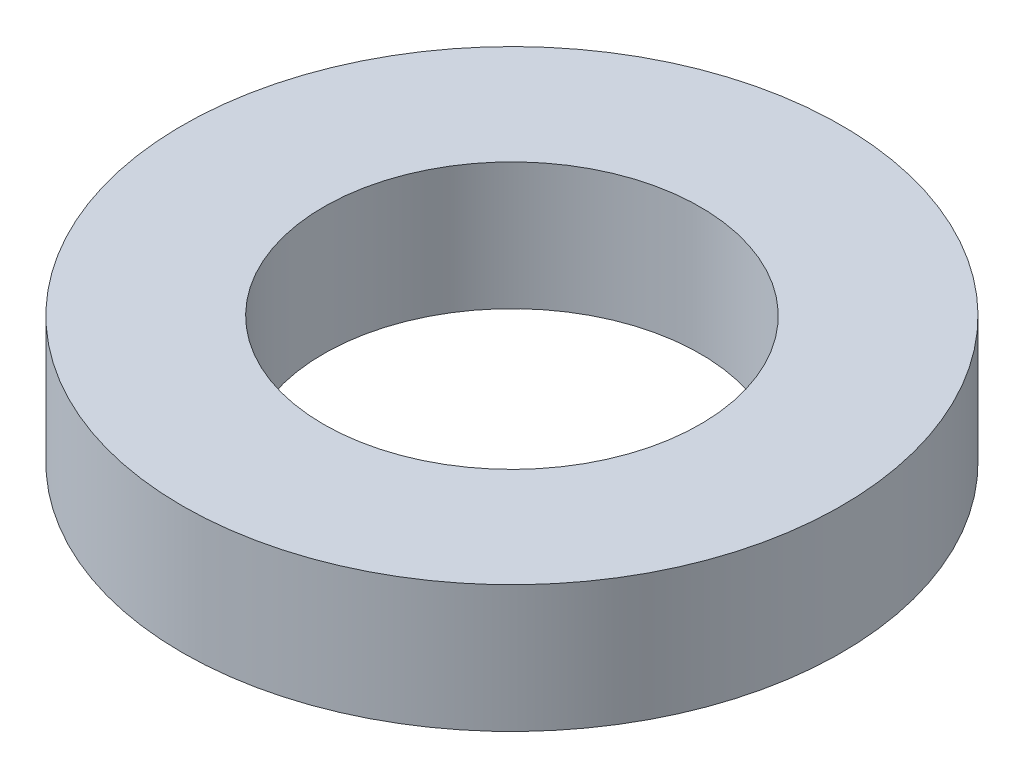
ISO-10303-21;
HEADER;
FILE_DESCRIPTION(('STEP AP214'),'2;1');
FILE_NAME('part.step','',(''),(''),'','','');
FILE_SCHEMA(('AUTOMOTIVE_DESIGN { 1 0 10303 214 1 1 1 1 }'));
ENDSEC;
DATA;
#1=APPLICATION_CONTEXT('core data for automotive mechanical design processes');
#2=APPLICATION_PROTOCOL_DEFINITION('international standard','automotive_design',2000,#1);
#3=PRODUCT_CONTEXT('',#1,'mechanical');
#4=PRODUCT('Part','Part','',(#3));
#5=PRODUCT_RELATED_PRODUCT_CATEGORY('part','',(#4));
#6=PRODUCT_DEFINITION_FORMATION('','',#4);
#7=PRODUCT_DEFINITION_CONTEXT('part definition',#1,'design');
#8=PRODUCT_DEFINITION('design','',#6,#7);
#9=PRODUCT_DEFINITION_SHAPE('','',#8);
#10=(LENGTH_UNIT() NAMED_UNIT(*) SI_UNIT(.MILLI.,.METRE.));
#11=(NAMED_UNIT(*) PLANE_ANGLE_UNIT() SI_UNIT($,.RADIAN.));
#12=(NAMED_UNIT(*) SI_UNIT($,.STERADIAN.) SOLID_ANGLE_UNIT());
#13=UNCERTAINTY_MEASURE_WITH_UNIT(LENGTH_MEASURE(1.E-05),#10,'distance_accuracy_value','');
#14=(GEOMETRIC_REPRESENTATION_CONTEXT(3) GLOBAL_UNCERTAINTY_ASSIGNED_CONTEXT((#13)) GLOBAL_UNIT_ASSIGNED_CONTEXT((#10,
#11,#12)) REPRESENTATION_CONTEXT('',''));
#15=CARTESIAN_POINT('',(0.,0.,0.));
#16=DIRECTION('',(0.,0.,1.));
#17=DIRECTION('',(1.,0.,0.));
#18=AXIS2_PLACEMENT_3D('',#15,#16,#17);
#19=CARTESIAN_POINT('',(0.,27.,0.));
#20=DIRECTION('',(0.,-1.,0.));
#21=DIRECTION('',(0.,0.,-1.));
#22=AXIS2_PLACEMENT_3D('',#19,#20,#21);
#23=CYLINDRICAL_SURFACE('',#22,70.);
#24=CARTESIAN_POINT('',(0.,27.,0.));
#25=DIRECTION('',(0.,1.,0.));
#26=DIRECTION('',(0.,0.,1.));
#27=AXIS2_PLACEMENT_3D('',#24,#25,#26);
#28=CIRCLE('',#27,70.);
#29=CARTESIAN_POINT('',(0.,27.,70.));
#30=VERTEX_POINT('',#29);
#31=EDGE_CURVE('E10',#30,#30,#28,.T.);
#32=ORIENTED_EDGE('',*,*,#31,.F.);
#33=EDGE_LOOP('',(#32));
#34=FACE_BOUND('',#33,.T.);
#35=CARTESIAN_POINT('',(0.,0.,0.));
#36=DIRECTION('',(0.,1.,0.));
#37=DIRECTION('',(0.,0.,1.));
#38=AXIS2_PLACEMENT_3D('',#35,#36,#37);
#39=CIRCLE('',#38,70.);
#40=CARTESIAN_POINT('',(0.,0.,70.));
#41=VERTEX_POINT('',#40);
#42=EDGE_CURVE('E37',#41,#41,#39,.T.);
#43=ORIENTED_EDGE('',*,*,#42,.T.);
#44=EDGE_LOOP('',(#43));
#45=FACE_BOUND('',#44,.T.);
#46=ADVANCED_FACE('F40',(#34,#45),#23,.T.);
#47=CARTESIAN_POINT('',(0.,27.,0.));
#48=DIRECTION('',(0.,1.,0.));
#49=DIRECTION('',(0.,0.,1.));
#50=AXIS2_PLACEMENT_3D('',#47,#48,#49);
#51=PLANE('',#50);
#52=CARTESIAN_POINT('',(0.,27.,0.));
#53=DIRECTION('',(0.,1.,0.));
#54=DIRECTION('',(0.,0.,1.));
#55=AXIS2_PLACEMENT_3D('',#52,#53,#54);
#56=CIRCLE('',#55,40.);
#57=CARTESIAN_POINT('',(0.,27.,40.));
#58=VERTEX_POINT('',#57);
#59=EDGE_CURVE('E50',#58,#58,#56,.T.);
#60=ORIENTED_EDGE('',*,*,#59,.F.);
#61=EDGE_LOOP('',(#60));
#62=FACE_BOUND('',#61,.T.);
#63=ORIENTED_EDGE('',*,*,#31,.T.);
#64=EDGE_LOOP('',(#63));
#65=FACE_BOUND('',#64,.T.);
#66=ADVANCED_FACE('F59',(#62,#65),#51,.T.);
#67=CARTESIAN_POINT('',(0.,0.,0.));
#68=DIRECTION('',(0.,1.,0.));
#69=DIRECTION('',(0.,0.,1.));
#70=AXIS2_PLACEMENT_3D('',#67,#68,#69);
#71=PLANE('',#70);
#72=CARTESIAN_POINT('',(0.,0.,0.));
#73=DIRECTION('',(0.,1.,0.));
#74=DIRECTION('',(0.,0.,1.));
#75=AXIS2_PLACEMENT_3D('',#72,#73,#74);
#76=CIRCLE('',#75,40.);
#77=CARTESIAN_POINT('',(0.,0.,40.));
#78=VERTEX_POINT('',#77);
#79=EDGE_CURVE('E47',#78,#78,#76,.T.);
#80=ORIENTED_EDGE('',*,*,#79,.T.);
#81=EDGE_LOOP('',(#80));
#82=FACE_BOUND('',#81,.T.);
#83=ORIENTED_EDGE('',*,*,#42,.F.);
#84=EDGE_LOOP('',(#83));
#85=FACE_BOUND('',#84,.T.);
#86=ADVANCED_FACE('F58',(#82,#85),#71,.F.);
#87=CARTESIAN_POINT('',(0.,27.,0.));
#88=DIRECTION('',(0.,-1.,0.));
#89=DIRECTION('',(0.,0.,-1.));
#90=AXIS2_PLACEMENT_3D('',#87,#88,#89);
#91=CYLINDRICAL_SURFACE('',#90,40.);
#92=ORIENTED_EDGE('',*,*,#59,.T.);
#93=EDGE_LOOP('',(#92));
#94=FACE_BOUND('',#93,.T.);
#95=ORIENTED_EDGE('',*,*,#79,.F.);
#96=EDGE_LOOP('',(#95));
#97=FACE_BOUND('',#96,.T.);
#98=ADVANCED_FACE('F54',(#94,#97),#91,.F.);
#99=CLOSED_SHELL('',(#46,#66,#86,#98));
#100=MANIFOLD_SOLID_BREP('B2',#99);
#101=ADVANCED_BREP_SHAPE_REPRESENTATION('',(#18,#100),#14);
#102=SHAPE_DEFINITION_REPRESENTATION(#9,#101);
ENDSEC;
END-ISO-10303-21;
